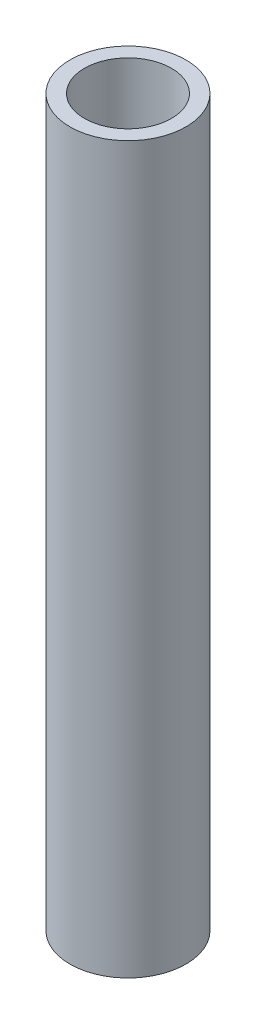
ISO-10303-21;
HEADER;
FILE_DESCRIPTION(('STEP AP214'),'2;1');
FILE_NAME('part.step','',(''),(''),'','','');
FILE_SCHEMA(('AUTOMOTIVE_DESIGN { 1 0 10303 214 1 1 1 1 }'));
ENDSEC;
DATA;
#1=APPLICATION_CONTEXT('core data for automotive mechanical design processes');
#2=APPLICATION_PROTOCOL_DEFINITION('international standard','automotive_design',2000,#1);
#3=PRODUCT_CONTEXT('',#1,'mechanical');
#4=PRODUCT('Part','Part','',(#3));
#5=PRODUCT_RELATED_PRODUCT_CATEGORY('part','',(#4));
#6=PRODUCT_DEFINITION_FORMATION('','',#4);
#7=PRODUCT_DEFINITION_CONTEXT('part definition',#1,'design');
#8=PRODUCT_DEFINITION('design','',#6,#7);
#9=PRODUCT_DEFINITION_SHAPE('','',#8);
#10=(LENGTH_UNIT() NAMED_UNIT(*) SI_UNIT(.MILLI.,.METRE.));
#11=(NAMED_UNIT(*) PLANE_ANGLE_UNIT() SI_UNIT($,.RADIAN.));
#12=(NAMED_UNIT(*) SI_UNIT($,.STERADIAN.) SOLID_ANGLE_UNIT());
#13=UNCERTAINTY_MEASURE_WITH_UNIT(LENGTH_MEASURE(1.E-05),#10,'distance_accuracy_value','');
#14=(GEOMETRIC_REPRESENTATION_CONTEXT(3) GLOBAL_UNCERTAINTY_ASSIGNED_CONTEXT((#13)) GLOBAL_UNIT_ASSIGNED_CONTEXT((#10,
#11,#12)) REPRESENTATION_CONTEXT('',''));
#15=CARTESIAN_POINT('',(0.,0.,0.));
#16=DIRECTION('',(0.,0.,1.));
#17=DIRECTION('',(1.,0.,0.));
#18=AXIS2_PLACEMENT_3D('',#15,#16,#17);
#19=CARTESIAN_POINT('',(0.,250.,0.));
#20=DIRECTION('',(0.,-1.,0.));
#21=DIRECTION('',(0.,0.,-1.));
#22=AXIS2_PLACEMENT_3D('',#19,#20,#21);
#23=CYLINDRICAL_SURFACE('',#22,20.);
#24=CARTESIAN_POINT('',(0.,250.,0.));
#25=DIRECTION('',(0.,1.,0.));
#26=DIRECTION('',(0.,0.,1.));
#27=AXIS2_PLACEMENT_3D('',#24,#25,#26);
#28=CIRCLE('',#27,20.);
#29=CARTESIAN_POINT('',(0.,250.,20.));
#30=VERTEX_POINT('',#29);
#31=EDGE_CURVE('E10',#30,#30,#28,.T.);
#32=ORIENTED_EDGE('',*,*,#31,.F.);
#33=EDGE_LOOP('',(#32));
#34=FACE_BOUND('',#33,.T.);
#35=CARTESIAN_POINT('',(0.,0.,0.));
#36=DIRECTION('',(0.,1.,0.));
#37=DIRECTION('',(0.,0.,1.));
#38=AXIS2_PLACEMENT_3D('',#35,#36,#37);
#39=CIRCLE('',#38,20.);
#40=CARTESIAN_POINT('',(0.,0.,20.));
#41=VERTEX_POINT('',#40);
#42=EDGE_CURVE('E42',#41,#41,#39,.T.);
#43=ORIENTED_EDGE('',*,*,#42,.T.);
#44=EDGE_LOOP('',(#43));
#45=FACE_BOUND('',#44,.T.);
#46=ADVANCED_FACE('F39',(#34,#45),#23,.T.);
#47=CARTESIAN_POINT('',(0.,250.,0.));
#48=DIRECTION('',(0.,1.,0.));
#49=DIRECTION('',(0.,0.,1.));
#50=AXIS2_PLACEMENT_3D('',#47,#48,#49);
#51=PLANE('',#50);
#52=CARTESIAN_POINT('',(0.,250.,0.));
#53=DIRECTION('',(0.,-1.,0.));
#54=DIRECTION('',(0.,0.,-1.));
#55=AXIS2_PLACEMENT_3D('',#52,#53,#54);
#56=CIRCLE('',#55,15.);
#57=CARTESIAN_POINT('',(0.,250.,-15.));
#58=VERTEX_POINT('',#57);
#59=EDGE_CURVE('E51',#58,#58,#56,.T.);
#60=ORIENTED_EDGE('',*,*,#59,.T.);
#61=EDGE_LOOP('',(#60));
#62=FACE_BOUND('',#61,.T.);
#63=ORIENTED_EDGE('',*,*,#31,.T.);
#64=EDGE_LOOP('',(#63));
#65=FACE_BOUND('',#64,.T.);
#66=ADVANCED_FACE('F61',(#62,#65),#51,.T.);
#67=CARTESIAN_POINT('',(0.,0.,0.));
#68=DIRECTION('',(0.,1.,0.));
#69=DIRECTION('',(0.,0.,1.));
#70=AXIS2_PLACEMENT_3D('',#67,#68,#69);
#71=PLANE('',#70);
#72=CARTESIAN_POINT('',(0.,0.,0.));
#73=DIRECTION('',(0.,-1.,0.));
#74=DIRECTION('',(0.,0.,-1.));
#75=AXIS2_PLACEMENT_3D('',#72,#73,#74);
#76=CIRCLE('',#75,15.);
#77=CARTESIAN_POINT('',(0.,0.,-15.));
#78=VERTEX_POINT('',#77);
#79=EDGE_CURVE('E53',#78,#78,#76,.T.);
#80=ORIENTED_EDGE('',*,*,#79,.F.);
#81=EDGE_LOOP('',(#80));
#82=FACE_BOUND('',#81,.T.);
#83=ORIENTED_EDGE('',*,*,#42,.F.);
#84=EDGE_LOOP('',(#83));
#85=FACE_BOUND('',#84,.T.);
#86=ADVANCED_FACE('F66',(#82,#85),#71,.F.);
#87=CARTESIAN_POINT('',(0.,250.,0.));
#88=DIRECTION('',(0.,-1.,0.));
#89=DIRECTION('',(0.,0.,-1.));
#90=AXIS2_PLACEMENT_3D('',#87,#88,#89);
#91=CYLINDRICAL_SURFACE('',#90,15.);
#92=ORIENTED_EDGE('',*,*,#59,.F.);
#93=EDGE_LOOP('',(#92));
#94=FACE_BOUND('',#93,.T.);
#95=ORIENTED_EDGE('',*,*,#79,.T.);
#96=EDGE_LOOP('',(#95));
#97=FACE_BOUND('',#96,.T.);
#98=ADVANCED_FACE('F63',(#94,#97),#91,.F.);
#99=CLOSED_SHELL('',(#46,#66,#86,#98));
#100=MANIFOLD_SOLID_BREP('B2',#99);
#101=ADVANCED_BREP_SHAPE_REPRESENTATION('',(#18,#100),#14);
#102=SHAPE_DEFINITION_REPRESENTATION(#9,#101);
ENDSEC;
END-ISO-10303-21;
